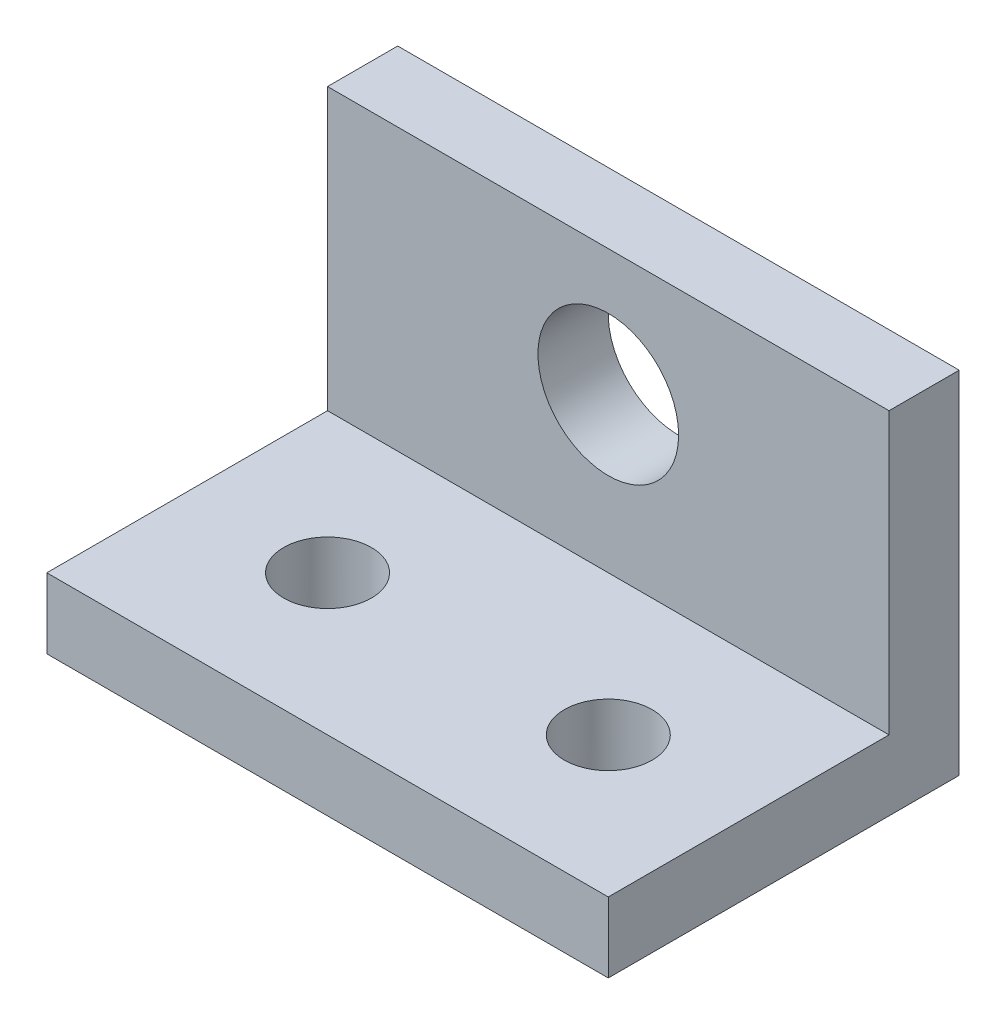
ISO-10303-21;
HEADER;
FILE_DESCRIPTION(('STEP AP214'),'2;1');
FILE_NAME('part.step','',(''),(''),'','','');
FILE_SCHEMA(('AUTOMOTIVE_DESIGN { 1 0 10303 214 1 1 1 1 }'));
ENDSEC;
DATA;
#1=APPLICATION_CONTEXT('core data for automotive mechanical design processes');
#2=APPLICATION_PROTOCOL_DEFINITION('international standard','automotive_design',2000,#1);
#3=PRODUCT_CONTEXT('',#1,'mechanical');
#4=PRODUCT('Part','Part','',(#3));
#5=PRODUCT_RELATED_PRODUCT_CATEGORY('part','',(#4));
#6=PRODUCT_DEFINITION_FORMATION('','',#4);
#7=PRODUCT_DEFINITION_CONTEXT('part definition',#1,'design');
#8=PRODUCT_DEFINITION('design','',#6,#7);
#9=PRODUCT_DEFINITION_SHAPE('','',#8);
#10=(LENGTH_UNIT() NAMED_UNIT(*) SI_UNIT(.MILLI.,.METRE.));
#11=(NAMED_UNIT(*) PLANE_ANGLE_UNIT() SI_UNIT($,.RADIAN.));
#12=(NAMED_UNIT(*) SI_UNIT($,.STERADIAN.) SOLID_ANGLE_UNIT());
#13=UNCERTAINTY_MEASURE_WITH_UNIT(LENGTH_MEASURE(1.E-05),#10,'distance_accuracy_value','');
#14=(GEOMETRIC_REPRESENTATION_CONTEXT(3) GLOBAL_UNCERTAINTY_ASSIGNED_CONTEXT((#13)) GLOBAL_UNIT_ASSIGNED_CONTEXT((#10,
#11,#12)) REPRESENTATION_CONTEXT('',''));
#15=CARTESIAN_POINT('',(0.,0.,0.));
#16=DIRECTION('',(0.,0.,1.));
#17=DIRECTION('',(1.,0.,0.));
#18=AXIS2_PLACEMENT_3D('',#15,#16,#17);
#19=CARTESIAN_POINT('',(50.8,0.,31.75));
#20=DIRECTION('',(0.,0.,1.));
#21=DIRECTION('',(1.,0.,0.));
#22=AXIS2_PLACEMENT_3D('',#19,#20,#21);
#23=PLANE('',#22);
#24=DIRECTION('',(0.,1.,0.));
#25=VECTOR('',#24,1.);
#26=CARTESIAN_POINT('',(0.,0.,31.75));
#27=LINE('',#26,#25);
#28=CARTESIAN_POINT('',(0.,0.,31.75));
#29=VERTEX_POINT('',#28);
#30=CARTESIAN_POINT('',(0.,6.35,31.75));
#31=VERTEX_POINT('',#30);
#32=EDGE_CURVE('E119',#29,#31,#27,.T.);
#33=ORIENTED_EDGE('',*,*,#32,.F.);
#34=DIRECTION('',(-1.,0.,0.));
#35=VECTOR('',#34,1.);
#36=CARTESIAN_POINT('',(50.8,0.,31.75));
#37=LINE('',#36,#35);
#38=CARTESIAN_POINT('',(50.8,0.,31.75));
#39=VERTEX_POINT('',#38);
#40=EDGE_CURVE('E11',#39,#29,#37,.T.);
#41=ORIENTED_EDGE('',*,*,#40,.F.);
#42=DIRECTION('',(0.,1.,0.));
#43=VECTOR('',#42,1.);
#44=CARTESIAN_POINT('',(50.8,0.,31.75));
#45=LINE('',#44,#43);
#46=CARTESIAN_POINT('',(50.8,6.35,31.75));
#47=VERTEX_POINT('',#46);
#48=EDGE_CURVE('E133',#39,#47,#45,.T.);
#49=ORIENTED_EDGE('',*,*,#48,.T.);
#50=DIRECTION('',(-1.,0.,0.));
#51=VECTOR('',#50,1.);
#52=CARTESIAN_POINT('',(50.8,6.35,31.75));
#53=LINE('',#52,#51);
#54=EDGE_CURVE('E81',#47,#31,#53,.T.);
#55=ORIENTED_EDGE('',*,*,#54,.T.);
#56=EDGE_LOOP('',(#33,#41,#49,#55));
#57=FACE_BOUND('',#56,.T.);
#58=ADVANCED_FACE('F37',(#57),#23,.T.);
#59=CARTESIAN_POINT('',(50.8,0.,0.));
#60=DIRECTION('',(0.,-1.,0.));
#61=DIRECTION('',(0.,0.,-1.));
#62=AXIS2_PLACEMENT_3D('',#59,#60,#61);
#63=PLANE('',#62);
#64=CARTESIAN_POINT('',(38.1,0.,19.05));
#65=DIRECTION('',(0.,-1.,0.));
#66=DIRECTION('',(0.,0.,-1.));
#67=AXIS2_PLACEMENT_3D('',#64,#65,#66);
#68=CIRCLE('',#67,3.96875);
#69=CARTESIAN_POINT('',(38.1,0.,15.08125));
#70=VERTEX_POINT('',#69);
#71=EDGE_CURVE('E162',#70,#70,#68,.F.);
#72=ORIENTED_EDGE('',*,*,#71,.T.);
#73=EDGE_LOOP('',(#72));
#74=FACE_BOUND('',#73,.T.);
#75=CARTESIAN_POINT('',(12.7,0.,19.05));
#76=DIRECTION('',(0.,-1.,0.));
#77=DIRECTION('',(0.,0.,-1.));
#78=AXIS2_PLACEMENT_3D('',#75,#76,#77);
#79=CIRCLE('',#78,3.96875);
#80=CARTESIAN_POINT('',(12.7,0.,15.08125));
#81=VERTEX_POINT('',#80);
#82=EDGE_CURVE('E156',#81,#81,#79,.F.);
#83=ORIENTED_EDGE('',*,*,#82,.T.);
#84=EDGE_LOOP('',(#83));
#85=FACE_BOUND('',#84,.T.);
#86=DIRECTION('',(0.,0.,1.));
#87=VECTOR('',#86,1.);
#88=CARTESIAN_POINT('',(0.,0.,0.));
#89=LINE('',#88,#87);
#90=CARTESIAN_POINT('',(0.,0.,0.));
#91=VERTEX_POINT('',#90);
#92=EDGE_CURVE('E122',#91,#29,#89,.T.);
#93=ORIENTED_EDGE('',*,*,#92,.F.);
#94=DIRECTION('',(-1.,0.,0.));
#95=VECTOR('',#94,1.);
#96=CARTESIAN_POINT('',(50.8,0.,0.));
#97=LINE('',#96,#95);
#98=CARTESIAN_POINT('',(50.8,0.,0.));
#99=VERTEX_POINT('',#98);
#100=EDGE_CURVE('E45',#99,#91,#97,.T.);
#101=ORIENTED_EDGE('',*,*,#100,.F.);
#102=DIRECTION('',(0.,0.,1.));
#103=VECTOR('',#102,1.);
#104=CARTESIAN_POINT('',(50.8,0.,0.));
#105=LINE('',#104,#103);
#106=EDGE_CURVE('E145',#99,#39,#105,.T.);
#107=ORIENTED_EDGE('',*,*,#106,.T.);
#108=ORIENTED_EDGE('',*,*,#40,.T.);
#109=EDGE_LOOP('',(#93,#101,#107,#108));
#110=FACE_BOUND('',#109,.T.);
#111=ADVANCED_FACE('F144',(#74,#85,#110),#63,.T.);
#112=CARTESIAN_POINT('',(50.8,0.,0.));
#113=DIRECTION('',(0.,0.,1.));
#114=DIRECTION('',(1.,0.,0.));
#115=AXIS2_PLACEMENT_3D('',#112,#113,#114);
#116=PLANE('',#115);
#117=CARTESIAN_POINT('',(25.4,20.32,0.));
#118=DIRECTION('',(0.,0.,1.));
#119=DIRECTION('',(1.,0.,0.));
#120=AXIS2_PLACEMENT_3D('',#117,#118,#119);
#121=CIRCLE('',#120,6.3627);
#122=CARTESIAN_POINT('',(31.7627,20.32,0.));
#123=VERTEX_POINT('',#122);
#124=EDGE_CURVE('E123',#123,#123,#121,.F.);
#125=ORIENTED_EDGE('',*,*,#124,.F.);
#126=EDGE_LOOP('',(#125));
#127=FACE_BOUND('',#126,.T.);
#128=DIRECTION('',(0.,1.,0.));
#129=VECTOR('',#128,1.);
#130=CARTESIAN_POINT('',(0.,0.,0.));
#131=LINE('',#130,#129);
#132=CARTESIAN_POINT('',(0.,31.75,0.));
#133=VERTEX_POINT('',#132);
#134=EDGE_CURVE('E126',#91,#133,#131,.T.);
#135=ORIENTED_EDGE('',*,*,#134,.T.);
#136=DIRECTION('',(-1.,0.,0.));
#137=VECTOR('',#136,1.);
#138=CARTESIAN_POINT('',(50.8,31.75,0.));
#139=LINE('',#138,#137);
#140=CARTESIAN_POINT('',(50.8,31.75,0.));
#141=VERTEX_POINT('',#140);
#142=EDGE_CURVE('E112',#141,#133,#139,.T.);
#143=ORIENTED_EDGE('',*,*,#142,.F.);
#144=DIRECTION('',(0.,1.,0.));
#145=VECTOR('',#144,1.);
#146=CARTESIAN_POINT('',(50.8,0.,0.));
#147=LINE('',#146,#145);
#148=EDGE_CURVE('E99',#99,#141,#147,.T.);
#149=ORIENTED_EDGE('',*,*,#148,.F.);
#150=ORIENTED_EDGE('',*,*,#100,.T.);
#151=EDGE_LOOP('',(#135,#143,#149,#150));
#152=FACE_BOUND('',#151,.T.);
#153=ADVANCED_FACE('F138',(#127,#152),#116,.F.);
#154=CARTESIAN_POINT('',(50.8,31.75,0.));
#155=DIRECTION('',(0.,-1.,0.));
#156=DIRECTION('',(0.,0.,-1.));
#157=AXIS2_PLACEMENT_3D('',#154,#155,#156);
#158=PLANE('',#157);
#159=DIRECTION('',(0.,0.,1.));
#160=VECTOR('',#159,1.);
#161=CARTESIAN_POINT('',(0.,31.75,0.));
#162=LINE('',#161,#160);
#163=CARTESIAN_POINT('',(0.,31.75,6.35));
#164=VERTEX_POINT('',#163);
#165=EDGE_CURVE('E108',#133,#164,#162,.T.);
#166=ORIENTED_EDGE('',*,*,#165,.T.);
#167=DIRECTION('',(-1.,0.,0.));
#168=VECTOR('',#167,1.);
#169=CARTESIAN_POINT('',(50.8,31.75,6.35));
#170=LINE('',#169,#168);
#171=CARTESIAN_POINT('',(50.8,31.75,6.35));
#172=VERTEX_POINT('',#171);
#173=EDGE_CURVE('E105',#172,#164,#170,.T.);
#174=ORIENTED_EDGE('',*,*,#173,.F.);
#175=DIRECTION('',(0.,0.,1.));
#176=VECTOR('',#175,1.);
#177=CARTESIAN_POINT('',(50.8,31.75,0.));
#178=LINE('',#177,#176);
#179=EDGE_CURVE('E92',#141,#172,#178,.T.);
#180=ORIENTED_EDGE('',*,*,#179,.F.);
#181=ORIENTED_EDGE('',*,*,#142,.T.);
#182=EDGE_LOOP('',(#166,#174,#180,#181));
#183=FACE_BOUND('',#182,.T.);
#184=ADVANCED_FACE('F106',(#183),#158,.F.);
#185=CARTESIAN_POINT('',(50.8,0.,6.35));
#186=DIRECTION('',(0.,0.,1.));
#187=DIRECTION('',(1.,0.,0.));
#188=AXIS2_PLACEMENT_3D('',#185,#186,#187);
#189=PLANE('',#188);
#190=CARTESIAN_POINT('',(25.4,20.32,6.35));
#191=DIRECTION('',(0.,0.,1.));
#192=DIRECTION('',(1.,0.,0.));
#193=AXIS2_PLACEMENT_3D('',#190,#191,#192);
#194=CIRCLE('',#193,6.3627);
#195=CARTESIAN_POINT('',(31.7627,20.32,6.35));
#196=VERTEX_POINT('',#195);
#197=EDGE_CURVE('E152',#196,#196,#194,.T.);
#198=ORIENTED_EDGE('',*,*,#197,.F.);
#199=EDGE_LOOP('',(#198));
#200=FACE_BOUND('',#199,.T.);
#201=DIRECTION('',(0.,1.,0.));
#202=VECTOR('',#201,1.);
#203=CARTESIAN_POINT('',(0.,0.,6.35));
#204=LINE('',#203,#202);
#205=CARTESIAN_POINT('',(0.,6.35,6.35));
#206=VERTEX_POINT('',#205);
#207=EDGE_CURVE('E129',#206,#164,#204,.T.);
#208=ORIENTED_EDGE('',*,*,#207,.F.);
#209=DIRECTION('',(-1.,0.,0.));
#210=VECTOR('',#209,1.);
#211=CARTESIAN_POINT('',(50.8,6.35,6.35));
#212=LINE('',#211,#210);
#213=CARTESIAN_POINT('',(50.8,6.35,6.35));
#214=VERTEX_POINT('',#213);
#215=EDGE_CURVE('E74',#214,#206,#212,.T.);
#216=ORIENTED_EDGE('',*,*,#215,.F.);
#217=DIRECTION('',(0.,1.,0.));
#218=VECTOR('',#217,1.);
#219=CARTESIAN_POINT('',(50.8,0.,6.35));
#220=LINE('',#219,#218);
#221=EDGE_CURVE('E96',#214,#172,#220,.T.);
#222=ORIENTED_EDGE('',*,*,#221,.T.);
#223=ORIENTED_EDGE('',*,*,#173,.T.);
#224=EDGE_LOOP('',(#208,#216,#222,#223));
#225=FACE_BOUND('',#224,.T.);
#226=ADVANCED_FACE('F114',(#200,#225),#189,.T.);
#227=CARTESIAN_POINT('',(50.8,6.35,0.));
#228=DIRECTION('',(0.,-1.,0.));
#229=DIRECTION('',(0.,0.,-1.));
#230=AXIS2_PLACEMENT_3D('',#227,#228,#229);
#231=PLANE('',#230);
#232=CARTESIAN_POINT('',(38.1,6.35,19.05));
#233=DIRECTION('',(0.,1.,0.));
#234=DIRECTION('',(0.,0.,1.));
#235=AXIS2_PLACEMENT_3D('',#232,#233,#234);
#236=CIRCLE('',#235,3.96875);
#237=CARTESIAN_POINT('',(38.1,6.35,23.01875));
#238=VERTEX_POINT('',#237);
#239=EDGE_CURVE('E159',#238,#238,#236,.T.);
#240=ORIENTED_EDGE('',*,*,#239,.F.);
#241=EDGE_LOOP('',(#240));
#242=FACE_BOUND('',#241,.T.);
#243=CARTESIAN_POINT('',(12.7,6.35,19.05));
#244=DIRECTION('',(0.,1.,0.));
#245=DIRECTION('',(0.,0.,1.));
#246=AXIS2_PLACEMENT_3D('',#243,#244,#245);
#247=CIRCLE('',#246,3.96875);
#248=CARTESIAN_POINT('',(12.7,6.35,23.01875));
#249=VERTEX_POINT('',#248);
#250=EDGE_CURVE('E155',#249,#249,#247,.T.);
#251=ORIENTED_EDGE('',*,*,#250,.F.);
#252=EDGE_LOOP('',(#251));
#253=FACE_BOUND('',#252,.T.);
#254=DIRECTION('',(0.,0.,1.));
#255=VECTOR('',#254,1.);
#256=CARTESIAN_POINT('',(0.,6.35,0.));
#257=LINE('',#256,#255);
#258=EDGE_CURVE('E131',#206,#31,#257,.T.);
#259=ORIENTED_EDGE('',*,*,#258,.T.);
#260=ORIENTED_EDGE('',*,*,#54,.F.);
#261=DIRECTION('',(0.,0.,1.));
#262=VECTOR('',#261,1.);
#263=CARTESIAN_POINT('',(50.8,6.35,0.));
#264=LINE('',#263,#262);
#265=EDGE_CURVE('E53',#214,#47,#264,.T.);
#266=ORIENTED_EDGE('',*,*,#265,.F.);
#267=ORIENTED_EDGE('',*,*,#215,.T.);
#268=EDGE_LOOP('',(#259,#260,#266,#267));
#269=FACE_BOUND('',#268,.T.);
#270=ADVANCED_FACE('F146',(#242,#253,#269),#231,.F.);
#271=CARTESIAN_POINT('',(50.8,0.,0.));
#272=DIRECTION('',(1.,0.,0.));
#273=DIRECTION('',(0.,0.,-1.));
#274=AXIS2_PLACEMENT_3D('',#271,#272,#273);
#275=PLANE('',#274);
#276=ORIENTED_EDGE('',*,*,#48,.F.);
#277=ORIENTED_EDGE('',*,*,#106,.F.);
#278=ORIENTED_EDGE('',*,*,#148,.T.);
#279=ORIENTED_EDGE('',*,*,#179,.T.);
#280=ORIENTED_EDGE('',*,*,#221,.F.);
#281=ORIENTED_EDGE('',*,*,#265,.T.);
#282=EDGE_LOOP('',(#276,#277,#278,#279,#280,#281));
#283=FACE_BOUND('',#282,.T.);
#284=ADVANCED_FACE('F94',(#283),#275,.T.);
#285=CARTESIAN_POINT('',(0.,0.,0.));
#286=DIRECTION('',(1.,0.,0.));
#287=DIRECTION('',(0.,0.,-1.));
#288=AXIS2_PLACEMENT_3D('',#285,#286,#287);
#289=PLANE('',#288);
#290=ORIENTED_EDGE('',*,*,#32,.T.);
#291=ORIENTED_EDGE('',*,*,#258,.F.);
#292=ORIENTED_EDGE('',*,*,#207,.T.);
#293=ORIENTED_EDGE('',*,*,#165,.F.);
#294=ORIENTED_EDGE('',*,*,#134,.F.);
#295=ORIENTED_EDGE('',*,*,#92,.T.);
#296=EDGE_LOOP('',(#290,#291,#292,#293,#294,#295));
#297=FACE_BOUND('',#296,.T.);
#298=ADVANCED_FACE('F143',(#297),#289,.F.);
#299=CARTESIAN_POINT('',(25.4,20.32,-0.00100000000000013));
#300=DIRECTION('',(0.,0.,1.));
#301=DIRECTION('',(1.,0.,0.));
#302=AXIS2_PLACEMENT_3D('',#299,#300,#301);
#303=CYLINDRICAL_SURFACE('',#302,6.3627);
#304=ORIENTED_EDGE('',*,*,#197,.T.);
#305=EDGE_LOOP('',(#304));
#306=FACE_BOUND('',#305,.T.);
#307=ORIENTED_EDGE('',*,*,#124,.T.);
#308=EDGE_LOOP('',(#307));
#309=FACE_BOUND('',#308,.T.);
#310=ADVANCED_FACE('F177',(#306,#309),#303,.F.);
#311=CARTESIAN_POINT('',(12.7,-0.0010000000000062,19.05));
#312=DIRECTION('',(0.,1.,0.));
#313=DIRECTION('',(0.,0.,1.));
#314=AXIS2_PLACEMENT_3D('',#311,#312,#313);
#315=CYLINDRICAL_SURFACE('',#314,3.96875);
#316=ORIENTED_EDGE('',*,*,#82,.F.);
#317=EDGE_LOOP('',(#316));
#318=FACE_BOUND('',#317,.T.);
#319=ORIENTED_EDGE('',*,*,#250,.T.);
#320=EDGE_LOOP('',(#319));
#321=FACE_BOUND('',#320,.T.);
#322=ADVANCED_FACE('F175',(#318,#321),#315,.F.);
#323=CARTESIAN_POINT('',(38.1,-0.0010000000000062,19.05));
#324=DIRECTION('',(0.,1.,0.));
#325=DIRECTION('',(0.,0.,1.));
#326=AXIS2_PLACEMENT_3D('',#323,#324,#325);
#327=CYLINDRICAL_SURFACE('',#326,3.96875);
#328=ORIENTED_EDGE('',*,*,#71,.F.);
#329=EDGE_LOOP('',(#328));
#330=FACE_BOUND('',#329,.T.);
#331=ORIENTED_EDGE('',*,*,#239,.T.);
#332=EDGE_LOOP('',(#331));
#333=FACE_BOUND('',#332,.T.);
#334=ADVANCED_FACE('F168',(#330,#333),#327,.F.);
#335=CLOSED_SHELL('',(#58,#111,#153,#184,#226,#270,#284,#298,#310,#322,#334));
#336=MANIFOLD_SOLID_BREP('B2',#335);
#337=ADVANCED_BREP_SHAPE_REPRESENTATION('',(#18,#336),#14);
#338=SHAPE_DEFINITION_REPRESENTATION(#9,#337);
ENDSEC;
END-ISO-10303-21;
